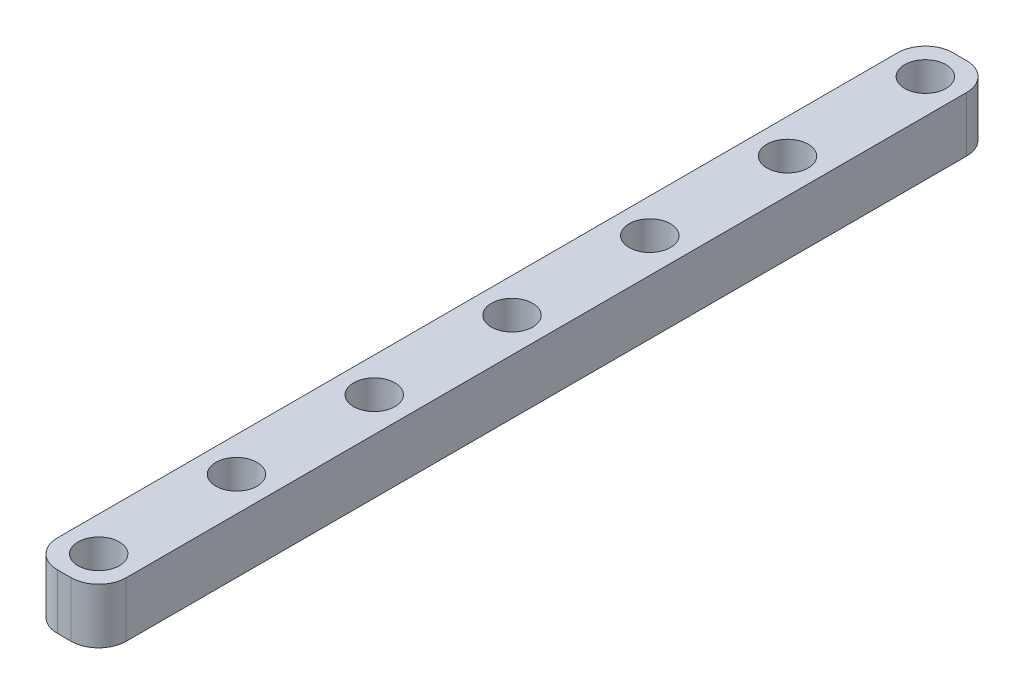
ISO-10303-21;
HEADER;
FILE_DESCRIPTION(('STEP AP214'),'2;1');
FILE_NAME('part.step','',(''),(''),'','','');
FILE_SCHEMA(('AUTOMOTIVE_DESIGN { 1 0 10303 214 1 1 1 1 }'));
ENDSEC;
DATA;
#1=APPLICATION_CONTEXT('core data for automotive mechanical design processes');
#2=APPLICATION_PROTOCOL_DEFINITION('international standard','automotive_design',2000,#1);
#3=PRODUCT_CONTEXT('',#1,'mechanical');
#4=PRODUCT('Part','Part','',(#3));
#5=PRODUCT_RELATED_PRODUCT_CATEGORY('part','',(#4));
#6=PRODUCT_DEFINITION_FORMATION('','',#4);
#7=PRODUCT_DEFINITION_CONTEXT('part definition',#1,'design');
#8=PRODUCT_DEFINITION('design','',#6,#7);
#9=PRODUCT_DEFINITION_SHAPE('','',#8);
#10=(LENGTH_UNIT() NAMED_UNIT(*) SI_UNIT(.MILLI.,.METRE.));
#11=(NAMED_UNIT(*) PLANE_ANGLE_UNIT() SI_UNIT($,.RADIAN.));
#12=(NAMED_UNIT(*) SI_UNIT($,.STERADIAN.) SOLID_ANGLE_UNIT());
#13=UNCERTAINTY_MEASURE_WITH_UNIT(LENGTH_MEASURE(1.E-05),#10,'distance_accuracy_value','');
#14=(GEOMETRIC_REPRESENTATION_CONTEXT(3) GLOBAL_UNCERTAINTY_ASSIGNED_CONTEXT((#13)) GLOBAL_UNIT_ASSIGNED_CONTEXT((#10,
#11,#12)) REPRESENTATION_CONTEXT('',''));
#15=CARTESIAN_POINT('',(0.,0.,0.));
#16=DIRECTION('',(0.,0.,1.));
#17=DIRECTION('',(1.,0.,0.));
#18=AXIS2_PLACEMENT_3D('',#15,#16,#17);
#19=CARTESIAN_POINT('',(0.,4.,0.));
#20=DIRECTION('',(0.,0.,1.));
#21=DIRECTION('',(1.,0.,0.));
#22=AXIS2_PLACEMENT_3D('',#19,#20,#21);
#23=PLANE('',#22);
#24=DIRECTION('',(-1.,0.,0.));
#25=VECTOR('',#24,1.);
#26=CARTESIAN_POINT('',(0.,4.,0.));
#27=LINE('',#26,#25);
#28=CARTESIAN_POINT('',(-2.,4.,0.));
#29=VERTEX_POINT('',#28);
#30=CARTESIAN_POINT('',(-3.,4.,0.));
#31=VERTEX_POINT('',#30);
#32=EDGE_CURVE('E146',#29,#31,#27,.T.);
#33=ORIENTED_EDGE('',*,*,#32,.T.);
#34=DIRECTION('',(0.,-1.,0.));
#35=VECTOR('',#34,1.);
#36=CARTESIAN_POINT('',(-3.,4.,0.));
#37=LINE('',#36,#35);
#38=CARTESIAN_POINT('',(-3.,0.,0.));
#39=VERTEX_POINT('',#38);
#40=EDGE_CURVE('E11',#31,#39,#37,.T.);
#41=ORIENTED_EDGE('',*,*,#40,.T.);
#42=DIRECTION('',(-1.,0.,0.));
#43=VECTOR('',#42,1.);
#44=CARTESIAN_POINT('',(0.,0.,0.));
#45=LINE('',#44,#43);
#46=CARTESIAN_POINT('',(-2.,0.,0.));
#47=VERTEX_POINT('',#46);
#48=EDGE_CURVE('E148',#47,#39,#45,.T.);
#49=ORIENTED_EDGE('',*,*,#48,.F.);
#50=DIRECTION('',(0.,-1.,0.));
#51=VECTOR('',#50,1.);
#52=CARTESIAN_POINT('',(-2.,4.,0.));
#53=LINE('',#52,#51);
#54=EDGE_CURVE('E54',#47,#29,#53,.F.);
#55=ORIENTED_EDGE('',*,*,#54,.T.);
#56=EDGE_LOOP('',(#33,#41,#49,#55));
#57=FACE_BOUND('',#56,.T.);
#58=ADVANCED_FACE('F45',(#57),#23,.T.);
#59=CARTESIAN_POINT('',(0.,4.,0.));
#60=DIRECTION('',(-1.,0.,0.));
#61=DIRECTION('',(0.,0.,1.));
#62=AXIS2_PLACEMENT_3D('',#59,#60,#61);
#63=PLANE('',#62);
#64=DIRECTION('',(0.,0.,-1.));
#65=VECTOR('',#64,1.);
#66=CARTESIAN_POINT('',(0.,0.,0.));
#67=LINE('',#66,#65);
#68=CARTESIAN_POINT('',(0.,0.,-2.));
#69=VERTEX_POINT('',#68);
#70=CARTESIAN_POINT('',(0.,0.,-63.));
#71=VERTEX_POINT('',#70);
#72=EDGE_CURVE('E141',#69,#71,#67,.T.);
#73=ORIENTED_EDGE('',*,*,#72,.T.);
#74=DIRECTION('',(0.,-1.,0.));
#75=VECTOR('',#74,1.);
#76=CARTESIAN_POINT('',(0.,4.,-63.));
#77=LINE('',#76,#75);
#78=CARTESIAN_POINT('',(0.,4.,-63.));
#79=VERTEX_POINT('',#78);
#80=EDGE_CURVE('E118',#71,#79,#77,.F.);
#81=ORIENTED_EDGE('',*,*,#80,.T.);
#82=DIRECTION('',(0.,0.,-1.));
#83=VECTOR('',#82,1.);
#84=CARTESIAN_POINT('',(0.,4.,0.));
#85=LINE('',#84,#83);
#86=CARTESIAN_POINT('',(0.,4.,-2.));
#87=VERTEX_POINT('',#86);
#88=EDGE_CURVE('E153',#87,#79,#85,.T.);
#89=ORIENTED_EDGE('',*,*,#88,.F.);
#90=DIRECTION('',(0.,-1.,0.));
#91=VECTOR('',#90,1.);
#92=CARTESIAN_POINT('',(0.,0.,-2.));
#93=LINE('',#92,#91);
#94=EDGE_CURVE('E124',#87,#69,#93,.T.);
#95=ORIENTED_EDGE('',*,*,#94,.T.);
#96=EDGE_LOOP('',(#73,#81,#89,#95));
#97=FACE_BOUND('',#96,.T.);
#98=ADVANCED_FACE('F202',(#97),#63,.F.);
#99=CARTESIAN_POINT('',(0.,4.,-65.));
#100=DIRECTION('',(0.,0.,1.));
#101=DIRECTION('',(1.,0.,0.));
#102=AXIS2_PLACEMENT_3D('',#99,#100,#101);
#103=PLANE('',#102);
#104=DIRECTION('',(-1.,0.,0.));
#105=VECTOR('',#104,1.);
#106=CARTESIAN_POINT('',(0.,4.,-65.));
#107=LINE('',#106,#105);
#108=CARTESIAN_POINT('',(-2.,4.,-65.));
#109=VERTEX_POINT('',#108);
#110=CARTESIAN_POINT('',(-3.,4.,-65.));
#111=VERTEX_POINT('',#110);
#112=EDGE_CURVE('E133',#109,#111,#107,.T.);
#113=ORIENTED_EDGE('',*,*,#112,.F.);
#114=DIRECTION('',(0.,-1.,0.));
#115=VECTOR('',#114,1.);
#116=CARTESIAN_POINT('',(-2.,4.,-65.));
#117=LINE('',#116,#115);
#118=CARTESIAN_POINT('',(-2.,0.,-65.));
#119=VERTEX_POINT('',#118);
#120=EDGE_CURVE('E117',#109,#119,#117,.T.);
#121=ORIENTED_EDGE('',*,*,#120,.T.);
#122=DIRECTION('',(-1.,0.,0.));
#123=VECTOR('',#122,1.);
#124=CARTESIAN_POINT('',(0.,0.,-65.));
#125=LINE('',#124,#123);
#126=CARTESIAN_POINT('',(-3.,0.,-65.));
#127=VERTEX_POINT('',#126);
#128=EDGE_CURVE('E131',#119,#127,#125,.T.);
#129=ORIENTED_EDGE('',*,*,#128,.T.);
#130=DIRECTION('',(0.,-1.,0.));
#131=VECTOR('',#130,1.);
#132=CARTESIAN_POINT('',(-3.,4.,-65.));
#133=LINE('',#132,#131);
#134=EDGE_CURVE('E136',#127,#111,#133,.F.);
#135=ORIENTED_EDGE('',*,*,#134,.T.);
#136=EDGE_LOOP('',(#113,#121,#129,#135));
#137=FACE_BOUND('',#136,.T.);
#138=ADVANCED_FACE('F130',(#137),#103,.F.);
#139=CARTESIAN_POINT('',(-5.,4.,0.));
#140=DIRECTION('',(-1.,0.,0.));
#141=DIRECTION('',(0.,0.,1.));
#142=AXIS2_PLACEMENT_3D('',#139,#140,#141);
#143=PLANE('',#142);
#144=DIRECTION('',(0.,0.,-1.));
#145=VECTOR('',#144,1.);
#146=CARTESIAN_POINT('',(-5.,4.,0.));
#147=LINE('',#146,#145);
#148=CARTESIAN_POINT('',(-5.,4.,-2.));
#149=VERTEX_POINT('',#148);
#150=CARTESIAN_POINT('',(-5.,4.,-63.));
#151=VERTEX_POINT('',#150);
#152=EDGE_CURVE('E198',#149,#151,#147,.T.);
#153=ORIENTED_EDGE('',*,*,#152,.T.);
#154=DIRECTION('',(0.,-1.,0.));
#155=VECTOR('',#154,1.);
#156=CARTESIAN_POINT('',(-5.,0.,-63.));
#157=LINE('',#156,#155);
#158=CARTESIAN_POINT('',(-5.,0.,-63.));
#159=VERTEX_POINT('',#158);
#160=EDGE_CURVE('E180',#151,#159,#157,.T.);
#161=ORIENTED_EDGE('',*,*,#160,.T.);
#162=DIRECTION('',(0.,0.,-1.));
#163=VECTOR('',#162,1.);
#164=CARTESIAN_POINT('',(-5.,0.,0.));
#165=LINE('',#164,#163);
#166=CARTESIAN_POINT('',(-5.,0.,-2.));
#167=VERTEX_POINT('',#166);
#168=EDGE_CURVE('E142',#167,#159,#165,.T.);
#169=ORIENTED_EDGE('',*,*,#168,.F.);
#170=DIRECTION('',(0.,-1.,0.));
#171=VECTOR('',#170,1.);
#172=CARTESIAN_POINT('',(-5.,4.,-2.));
#173=LINE('',#172,#171);
#174=EDGE_CURVE('E68',#167,#149,#173,.F.);
#175=ORIENTED_EDGE('',*,*,#174,.T.);
#176=EDGE_LOOP('',(#153,#161,#169,#175));
#177=FACE_BOUND('',#176,.T.);
#178=ADVANCED_FACE('F272',(#177),#143,.T.);
#179=CARTESIAN_POINT('',(0.,4.,0.));
#180=DIRECTION('',(0.,-1.,0.));
#181=DIRECTION('',(0.,0.,-1.));
#182=AXIS2_PLACEMENT_3D('',#179,#180,#181);
#183=PLANE('',#182);
#184=CARTESIAN_POINT('',(-2.5,4.,-62.5));
#185=DIRECTION('',(0.,1.,0.));
#186=DIRECTION('',(0.,0.,1.));
#187=AXIS2_PLACEMENT_3D('',#184,#185,#186);
#188=CIRCLE('',#187,1.5);
#189=CARTESIAN_POINT('',(-2.5,4.,-61.));
#190=VERTEX_POINT('',#189);
#191=EDGE_CURVE('E224',#190,#190,#188,.T.);
#192=ORIENTED_EDGE('',*,*,#191,.F.);
#193=EDGE_LOOP('',(#192));
#194=FACE_BOUND('',#193,.T.);
#195=CARTESIAN_POINT('',(-2.5,4.,-52.5));
#196=DIRECTION('',(0.,1.,0.));
#197=DIRECTION('',(0.,0.,1.));
#198=AXIS2_PLACEMENT_3D('',#195,#196,#197);
#199=CIRCLE('',#198,1.5);
#200=CARTESIAN_POINT('',(-2.5,4.,-51.));
#201=VERTEX_POINT('',#200);
#202=EDGE_CURVE('E232',#201,#201,#199,.T.);
#203=ORIENTED_EDGE('',*,*,#202,.F.);
#204=EDGE_LOOP('',(#203));
#205=FACE_BOUND('',#204,.T.);
#206=CARTESIAN_POINT('',(-2.5,4.,-22.5));
#207=DIRECTION('',(0.,1.,0.));
#208=DIRECTION('',(0.,0.,1.));
#209=AXIS2_PLACEMENT_3D('',#206,#207,#208);
#210=CIRCLE('',#209,1.5);
#211=CARTESIAN_POINT('',(-2.5,4.,-21.));
#212=VERTEX_POINT('',#211);
#213=EDGE_CURVE('E218',#212,#212,#210,.T.);
#214=ORIENTED_EDGE('',*,*,#213,.F.);
#215=EDGE_LOOP('',(#214));
#216=FACE_BOUND('',#215,.T.);
#217=CARTESIAN_POINT('',(-2.5,4.,-12.5));
#218=DIRECTION('',(0.,1.,0.));
#219=DIRECTION('',(0.,0.,1.));
#220=AXIS2_PLACEMENT_3D('',#217,#218,#219);
#221=CIRCLE('',#220,1.5);
#222=CARTESIAN_POINT('',(-2.5,4.,-11.));
#223=VERTEX_POINT('',#222);
#224=EDGE_CURVE('E241',#223,#223,#221,.T.);
#225=ORIENTED_EDGE('',*,*,#224,.F.);
#226=EDGE_LOOP('',(#225));
#227=FACE_BOUND('',#226,.T.);
#228=CARTESIAN_POINT('',(-2.5,4.,-2.5));
#229=DIRECTION('',(0.,1.,0.));
#230=DIRECTION('',(0.,0.,1.));
#231=AXIS2_PLACEMENT_3D('',#228,#229,#230);
#232=CIRCLE('',#231,1.5);
#233=CARTESIAN_POINT('',(-2.5,4.,-1.));
#234=VERTEX_POINT('',#233);
#235=EDGE_CURVE('E242',#234,#234,#232,.T.);
#236=ORIENTED_EDGE('',*,*,#235,.F.);
#237=EDGE_LOOP('',(#236));
#238=FACE_BOUND('',#237,.T.);
#239=CARTESIAN_POINT('',(-2.5,4.,-42.5));
#240=DIRECTION('',(0.,1.,0.));
#241=DIRECTION('',(0.,0.,1.));
#242=AXIS2_PLACEMENT_3D('',#239,#240,#241);
#243=CIRCLE('',#242,1.5);
#244=CARTESIAN_POINT('',(-2.5,4.,-41.));
#245=VERTEX_POINT('',#244);
#246=EDGE_CURVE('E256',#245,#245,#243,.T.);
#247=ORIENTED_EDGE('',*,*,#246,.F.);
#248=EDGE_LOOP('',(#247));
#249=FACE_BOUND('',#248,.T.);
#250=CARTESIAN_POINT('',(-2.5,4.,-32.5));
#251=DIRECTION('',(0.,1.,0.));
#252=DIRECTION('',(0.,0.,1.));
#253=AXIS2_PLACEMENT_3D('',#250,#251,#252);
#254=CIRCLE('',#253,1.5);
#255=CARTESIAN_POINT('',(-2.5,4.,-31.));
#256=VERTEX_POINT('',#255);
#257=EDGE_CURVE('E207',#256,#256,#254,.T.);
#258=ORIENTED_EDGE('',*,*,#257,.F.);
#259=EDGE_LOOP('',(#258));
#260=FACE_BOUND('',#259,.T.);
#261=ORIENTED_EDGE('',*,*,#88,.T.);
#262=CARTESIAN_POINT('',(-2.,4.,-63.));
#263=DIRECTION('',(0.,-1.,0.));
#264=DIRECTION('',(0.,0.,-1.));
#265=AXIS2_PLACEMENT_3D('',#262,#263,#264);
#266=CIRCLE('',#265,2.);
#267=EDGE_CURVE('E175',#79,#109,#266,.F.);
#268=ORIENTED_EDGE('',*,*,#267,.T.);
#269=ORIENTED_EDGE('',*,*,#112,.T.);
#270=CARTESIAN_POINT('',(-3.,4.,-63.));
#271=DIRECTION('',(0.,-1.,0.));
#272=DIRECTION('',(0.,0.,-1.));
#273=AXIS2_PLACEMENT_3D('',#270,#271,#272);
#274=CIRCLE('',#273,2.);
#275=EDGE_CURVE('E61',#111,#151,#274,.F.);
#276=ORIENTED_EDGE('',*,*,#275,.T.);
#277=ORIENTED_EDGE('',*,*,#152,.F.);
#278=CARTESIAN_POINT('',(-3.,4.,-2.));
#279=DIRECTION('',(0.,-1.,0.));
#280=DIRECTION('',(0.,0.,-1.));
#281=AXIS2_PLACEMENT_3D('',#278,#279,#280);
#282=CIRCLE('',#281,2.);
#283=EDGE_CURVE('E170',#149,#31,#282,.F.);
#284=ORIENTED_EDGE('',*,*,#283,.T.);
#285=ORIENTED_EDGE('',*,*,#32,.F.);
#286=CARTESIAN_POINT('',(-2.,4.,-2.));
#287=DIRECTION('',(0.,-1.,0.));
#288=DIRECTION('',(0.,0.,-1.));
#289=AXIS2_PLACEMENT_3D('',#286,#287,#288);
#290=CIRCLE('',#289,2.);
#291=EDGE_CURVE('E167',#29,#87,#290,.F.);
#292=ORIENTED_EDGE('',*,*,#291,.T.);
#293=EDGE_LOOP('',(#261,#268,#269,#276,#277,#284,#285,#292));
#294=FACE_BOUND('',#293,.T.);
#295=ADVANCED_FACE('F194',(#194,#205,#216,#227,#238,#249,#260,#294),#183,.F.);
#296=CARTESIAN_POINT('',(0.,0.,0.));
#297=DIRECTION('',(0.,-1.,0.));
#298=DIRECTION('',(0.,0.,-1.));
#299=AXIS2_PLACEMENT_3D('',#296,#297,#298);
#300=PLANE('',#299);
#301=CARTESIAN_POINT('',(-2.5,0.,-62.5));
#302=DIRECTION('',(0.,1.,0.));
#303=DIRECTION('',(0.,0.,1.));
#304=AXIS2_PLACEMENT_3D('',#301,#302,#303);
#305=CIRCLE('',#304,1.5);
#306=CARTESIAN_POINT('',(-2.5,0.,-61.));
#307=VERTEX_POINT('',#306);
#308=EDGE_CURVE('E220',#307,#307,#305,.T.);
#309=ORIENTED_EDGE('',*,*,#308,.T.);
#310=EDGE_LOOP('',(#309));
#311=FACE_BOUND('',#310,.T.);
#312=CARTESIAN_POINT('',(-2.5,0.,-52.5));
#313=DIRECTION('',(0.,1.,0.));
#314=DIRECTION('',(0.,0.,1.));
#315=AXIS2_PLACEMENT_3D('',#312,#313,#314);
#316=CIRCLE('',#315,1.5);
#317=CARTESIAN_POINT('',(-2.5,0.,-51.));
#318=VERTEX_POINT('',#317);
#319=EDGE_CURVE('E228',#318,#318,#316,.T.);
#320=ORIENTED_EDGE('',*,*,#319,.T.);
#321=EDGE_LOOP('',(#320));
#322=FACE_BOUND('',#321,.T.);
#323=CARTESIAN_POINT('',(-2.5,0.,-22.5));
#324=DIRECTION('',(0.,1.,0.));
#325=DIRECTION('',(0.,0.,1.));
#326=AXIS2_PLACEMENT_3D('',#323,#324,#325);
#327=CIRCLE('',#326,1.5);
#328=CARTESIAN_POINT('',(-2.5,0.,-21.));
#329=VERTEX_POINT('',#328);
#330=EDGE_CURVE('E246',#329,#329,#327,.T.);
#331=ORIENTED_EDGE('',*,*,#330,.T.);
#332=EDGE_LOOP('',(#331));
#333=FACE_BOUND('',#332,.T.);
#334=CARTESIAN_POINT('',(-2.5,0.,-12.5));
#335=DIRECTION('',(0.,1.,0.));
#336=DIRECTION('',(0.,0.,1.));
#337=AXIS2_PLACEMENT_3D('',#334,#335,#336);
#338=CIRCLE('',#337,1.5);
#339=CARTESIAN_POINT('',(-2.5,0.,-11.));
#340=VERTEX_POINT('',#339);
#341=EDGE_CURVE('E237',#340,#340,#338,.T.);
#342=ORIENTED_EDGE('',*,*,#341,.T.);
#343=EDGE_LOOP('',(#342));
#344=FACE_BOUND('',#343,.T.);
#345=CARTESIAN_POINT('',(-2.5,0.,-2.5));
#346=DIRECTION('',(0.,1.,0.));
#347=DIRECTION('',(0.,0.,1.));
#348=AXIS2_PLACEMENT_3D('',#345,#346,#347);
#349=CIRCLE('',#348,1.5);
#350=CARTESIAN_POINT('',(-2.5,0.,-1.));
#351=VERTEX_POINT('',#350);
#352=EDGE_CURVE('E260',#351,#351,#349,.T.);
#353=ORIENTED_EDGE('',*,*,#352,.T.);
#354=EDGE_LOOP('',(#353));
#355=FACE_BOUND('',#354,.T.);
#356=CARTESIAN_POINT('',(-2.5,0.,-42.5));
#357=DIRECTION('',(0.,1.,0.));
#358=DIRECTION('',(0.,0.,1.));
#359=AXIS2_PLACEMENT_3D('',#356,#357,#358);
#360=CIRCLE('',#359,1.5);
#361=CARTESIAN_POINT('',(-2.5,0.,-41.));
#362=VERTEX_POINT('',#361);
#363=EDGE_CURVE('E236',#362,#362,#360,.T.);
#364=ORIENTED_EDGE('',*,*,#363,.T.);
#365=EDGE_LOOP('',(#364));
#366=FACE_BOUND('',#365,.T.);
#367=CARTESIAN_POINT('',(-2.5,0.,-32.5));
#368=DIRECTION('',(0.,1.,0.));
#369=DIRECTION('',(0.,0.,1.));
#370=AXIS2_PLACEMENT_3D('',#367,#368,#369);
#371=CIRCLE('',#370,1.5);
#372=CARTESIAN_POINT('',(-2.5,0.,-31.));
#373=VERTEX_POINT('',#372);
#374=EDGE_CURVE('E204',#373,#373,#371,.T.);
#375=ORIENTED_EDGE('',*,*,#374,.T.);
#376=EDGE_LOOP('',(#375));
#377=FACE_BOUND('',#376,.T.);
#378=ORIENTED_EDGE('',*,*,#128,.F.);
#379=CARTESIAN_POINT('',(-2.,0.,-63.));
#380=DIRECTION('',(0.,-1.,0.));
#381=DIRECTION('',(0.,0.,-1.));
#382=AXIS2_PLACEMENT_3D('',#379,#380,#381);
#383=CIRCLE('',#382,2.);
#384=EDGE_CURVE('E113',#119,#71,#383,.T.);
#385=ORIENTED_EDGE('',*,*,#384,.T.);
#386=ORIENTED_EDGE('',*,*,#72,.F.);
#387=CARTESIAN_POINT('',(-2.,0.,-2.));
#388=DIRECTION('',(0.,-1.,0.));
#389=DIRECTION('',(0.,0.,-1.));
#390=AXIS2_PLACEMENT_3D('',#387,#388,#389);
#391=CIRCLE('',#390,2.);
#392=EDGE_CURVE('E135',#69,#47,#391,.T.);
#393=ORIENTED_EDGE('',*,*,#392,.T.);
#394=ORIENTED_EDGE('',*,*,#48,.T.);
#395=CARTESIAN_POINT('',(-3.,0.,-2.));
#396=DIRECTION('',(0.,-1.,0.));
#397=DIRECTION('',(0.,0.,-1.));
#398=AXIS2_PLACEMENT_3D('',#395,#396,#397);
#399=CIRCLE('',#398,2.);
#400=EDGE_CURVE('E157',#39,#167,#399,.T.);
#401=ORIENTED_EDGE('',*,*,#400,.T.);
#402=ORIENTED_EDGE('',*,*,#168,.T.);
#403=CARTESIAN_POINT('',(-3.,0.,-63.));
#404=DIRECTION('',(0.,-1.,0.));
#405=DIRECTION('',(0.,0.,-1.));
#406=AXIS2_PLACEMENT_3D('',#403,#404,#405);
#407=CIRCLE('',#406,2.);
#408=EDGE_CURVE('E125',#159,#127,#407,.T.);
#409=ORIENTED_EDGE('',*,*,#408,.T.);
#410=EDGE_LOOP('',(#378,#385,#386,#393,#394,#401,#402,#409));
#411=FACE_BOUND('',#410,.T.);
#412=ADVANCED_FACE('F138',(#311,#322,#333,#344,#355,#366,#377,#411),#300,.T.);
#413=CARTESIAN_POINT('',(-2.5,0.,-32.5));
#414=DIRECTION('',(0.,1.,0.));
#415=DIRECTION('',(0.,0.,1.));
#416=AXIS2_PLACEMENT_3D('',#413,#414,#415);
#417=CYLINDRICAL_SURFACE('',#416,1.5);
#418=ORIENTED_EDGE('',*,*,#374,.F.);
#419=EDGE_LOOP('',(#418));
#420=FACE_BOUND('',#419,.T.);
#421=ORIENTED_EDGE('',*,*,#257,.T.);
#422=EDGE_LOOP('',(#421));
#423=FACE_BOUND('',#422,.T.);
#424=ADVANCED_FACE('F279',(#420,#423),#417,.F.);
#425=CARTESIAN_POINT('',(-2.5,0.,-42.5));
#426=DIRECTION('',(0.,1.,0.));
#427=DIRECTION('',(0.,0.,1.));
#428=AXIS2_PLACEMENT_3D('',#425,#426,#427);
#429=CYLINDRICAL_SURFACE('',#428,1.5);
#430=ORIENTED_EDGE('',*,*,#363,.F.);
#431=EDGE_LOOP('',(#430));
#432=FACE_BOUND('',#431,.T.);
#433=ORIENTED_EDGE('',*,*,#246,.T.);
#434=EDGE_LOOP('',(#433));
#435=FACE_BOUND('',#434,.T.);
#436=ADVANCED_FACE('F281',(#432,#435),#429,.F.);
#437=CARTESIAN_POINT('',(-2.5,0.,-2.5));
#438=DIRECTION('',(0.,1.,0.));
#439=DIRECTION('',(0.,0.,1.));
#440=AXIS2_PLACEMENT_3D('',#437,#438,#439);
#441=CYLINDRICAL_SURFACE('',#440,1.5);
#442=ORIENTED_EDGE('',*,*,#352,.F.);
#443=EDGE_LOOP('',(#442));
#444=FACE_BOUND('',#443,.T.);
#445=ORIENTED_EDGE('',*,*,#235,.T.);
#446=EDGE_LOOP('',(#445));
#447=FACE_BOUND('',#446,.T.);
#448=ADVANCED_FACE('F268',(#444,#447),#441,.F.);
#449=CARTESIAN_POINT('',(-2.5,0.,-12.5));
#450=DIRECTION('',(0.,1.,0.));
#451=DIRECTION('',(0.,0.,1.));
#452=AXIS2_PLACEMENT_3D('',#449,#450,#451);
#453=CYLINDRICAL_SURFACE('',#452,1.5);
#454=ORIENTED_EDGE('',*,*,#341,.F.);
#455=EDGE_LOOP('',(#454));
#456=FACE_BOUND('',#455,.T.);
#457=ORIENTED_EDGE('',*,*,#224,.T.);
#458=EDGE_LOOP('',(#457));
#459=FACE_BOUND('',#458,.T.);
#460=ADVANCED_FACE('F362',(#456,#459),#453,.F.);
#461=CARTESIAN_POINT('',(-2.5,0.,-22.5));
#462=DIRECTION('',(0.,1.,0.));
#463=DIRECTION('',(0.,0.,1.));
#464=AXIS2_PLACEMENT_3D('',#461,#462,#463);
#465=CYLINDRICAL_SURFACE('',#464,1.5);
#466=ORIENTED_EDGE('',*,*,#330,.F.);
#467=EDGE_LOOP('',(#466));
#468=FACE_BOUND('',#467,.T.);
#469=ORIENTED_EDGE('',*,*,#213,.T.);
#470=EDGE_LOOP('',(#469));
#471=FACE_BOUND('',#470,.T.);
#472=ADVANCED_FACE('F352',(#468,#471),#465,.F.);
#473=CARTESIAN_POINT('',(-2.5,0.,-52.5));
#474=DIRECTION('',(0.,1.,0.));
#475=DIRECTION('',(0.,0.,1.));
#476=AXIS2_PLACEMENT_3D('',#473,#474,#475);
#477=CYLINDRICAL_SURFACE('',#476,1.5);
#478=ORIENTED_EDGE('',*,*,#319,.F.);
#479=EDGE_LOOP('',(#478));
#480=FACE_BOUND('',#479,.T.);
#481=ORIENTED_EDGE('',*,*,#202,.T.);
#482=EDGE_LOOP('',(#481));
#483=FACE_BOUND('',#482,.T.);
#484=ADVANCED_FACE('F343',(#480,#483),#477,.F.);
#485=CARTESIAN_POINT('',(-2.5,0.,-62.5));
#486=DIRECTION('',(0.,1.,0.));
#487=DIRECTION('',(0.,0.,1.));
#488=AXIS2_PLACEMENT_3D('',#485,#486,#487);
#489=CYLINDRICAL_SURFACE('',#488,1.5);
#490=ORIENTED_EDGE('',*,*,#308,.F.);
#491=EDGE_LOOP('',(#490));
#492=FACE_BOUND('',#491,.T.);
#493=ORIENTED_EDGE('',*,*,#191,.T.);
#494=EDGE_LOOP('',(#493));
#495=FACE_BOUND('',#494,.T.);
#496=ADVANCED_FACE('F307',(#492,#495),#489,.F.);
#497=CARTESIAN_POINT('',(-2.,4.,-63.));
#498=DIRECTION('',(0.,-1.,0.));
#499=DIRECTION('',(0.,0.,-1.));
#500=AXIS2_PLACEMENT_3D('',#497,#498,#499);
#501=CYLINDRICAL_SURFACE('',#500,2.);
#502=ORIENTED_EDGE('',*,*,#267,.F.);
#503=ORIENTED_EDGE('',*,*,#80,.F.);
#504=ORIENTED_EDGE('',*,*,#384,.F.);
#505=ORIENTED_EDGE('',*,*,#120,.F.);
#506=EDGE_LOOP('',(#502,#503,#504,#505));
#507=FACE_BOUND('',#506,.T.);
#508=ADVANCED_FACE('F116',(#507),#501,.T.);
#509=CARTESIAN_POINT('',(-3.,4.,-63.));
#510=DIRECTION('',(0.,1.,0.));
#511=DIRECTION('',(0.,0.,1.));
#512=AXIS2_PLACEMENT_3D('',#509,#510,#511);
#513=CYLINDRICAL_SURFACE('',#512,2.);
#514=ORIENTED_EDGE('',*,*,#275,.F.);
#515=ORIENTED_EDGE('',*,*,#134,.F.);
#516=ORIENTED_EDGE('',*,*,#408,.F.);
#517=ORIENTED_EDGE('',*,*,#160,.F.);
#518=EDGE_LOOP('',(#514,#515,#516,#517));
#519=FACE_BOUND('',#518,.T.);
#520=ADVANCED_FACE('F306',(#519),#513,.T.);
#521=CARTESIAN_POINT('',(-3.,4.,-2.));
#522=DIRECTION('',(0.,-1.,0.));
#523=DIRECTION('',(0.,0.,-1.));
#524=AXIS2_PLACEMENT_3D('',#521,#522,#523);
#525=CYLINDRICAL_SURFACE('',#524,2.);
#526=ORIENTED_EDGE('',*,*,#283,.F.);
#527=ORIENTED_EDGE('',*,*,#174,.F.);
#528=ORIENTED_EDGE('',*,*,#400,.F.);
#529=ORIENTED_EDGE('',*,*,#40,.F.);
#530=EDGE_LOOP('',(#526,#527,#528,#529));
#531=FACE_BOUND('',#530,.T.);
#532=ADVANCED_FACE('F309',(#531),#525,.T.);
#533=CARTESIAN_POINT('',(-2.,4.,-2.));
#534=DIRECTION('',(0.,1.,0.));
#535=DIRECTION('',(0.,0.,1.));
#536=AXIS2_PLACEMENT_3D('',#533,#534,#535);
#537=CYLINDRICAL_SURFACE('',#536,2.);
#538=ORIENTED_EDGE('',*,*,#291,.F.);
#539=ORIENTED_EDGE('',*,*,#54,.F.);
#540=ORIENTED_EDGE('',*,*,#392,.F.);
#541=ORIENTED_EDGE('',*,*,#94,.F.);
#542=EDGE_LOOP('',(#538,#539,#540,#541));
#543=FACE_BOUND('',#542,.T.);
#544=ADVANCED_FACE('F47',(#543),#537,.T.);
#545=CLOSED_SHELL('',(#58,#98,#138,#178,#295,#412,#424,#436,#448,#460,#472,#484,#496,#508,#520,
#532,#544));
#546=MANIFOLD_SOLID_BREP('B2',#545);
#547=ADVANCED_BREP_SHAPE_REPRESENTATION('',(#18,#546),#14);
#548=SHAPE_DEFINITION_REPRESENTATION(#9,#547);
ENDSEC;
END-ISO-10303-21;
